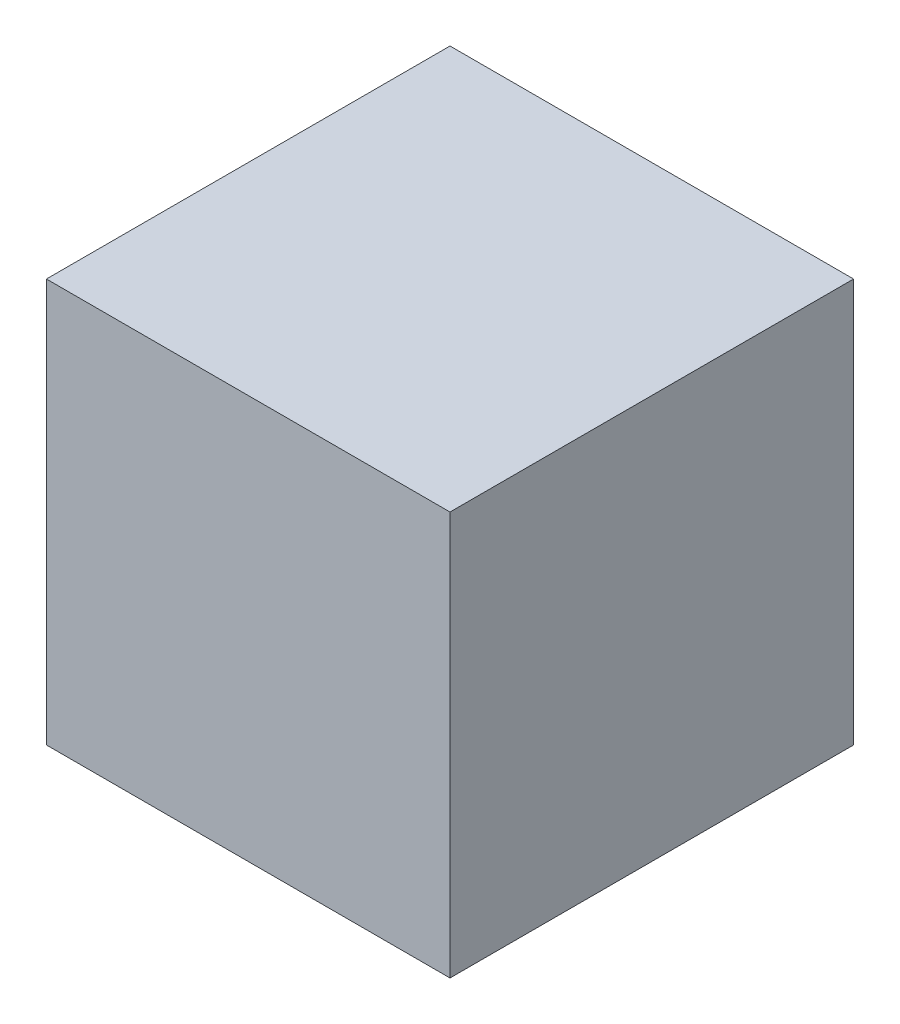
ISO-10303-21;
HEADER;
FILE_DESCRIPTION(('STEP AP214'),'2;1');
FILE_NAME('part.step','',(''),(''),'','','');
FILE_SCHEMA(('AUTOMOTIVE_DESIGN { 1 0 10303 214 1 1 1 1 }'));
ENDSEC;
DATA;
#1=APPLICATION_CONTEXT('core data for automotive mechanical design processes');
#2=APPLICATION_PROTOCOL_DEFINITION('international standard','automotive_design',2000,#1);
#3=PRODUCT_CONTEXT('',#1,'mechanical');
#4=PRODUCT('Part','Part','',(#3));
#5=PRODUCT_RELATED_PRODUCT_CATEGORY('part','',(#4));
#6=PRODUCT_DEFINITION_FORMATION('','',#4);
#7=PRODUCT_DEFINITION_CONTEXT('part definition',#1,'design');
#8=PRODUCT_DEFINITION('design','',#6,#7);
#9=PRODUCT_DEFINITION_SHAPE('','',#8);
#10=(LENGTH_UNIT() NAMED_UNIT(*) SI_UNIT(.MILLI.,.METRE.));
#11=(NAMED_UNIT(*) PLANE_ANGLE_UNIT() SI_UNIT($,.RADIAN.));
#12=(NAMED_UNIT(*) SI_UNIT($,.STERADIAN.) SOLID_ANGLE_UNIT());
#13=UNCERTAINTY_MEASURE_WITH_UNIT(LENGTH_MEASURE(1.E-05),#10,'distance_accuracy_value','');
#14=(GEOMETRIC_REPRESENTATION_CONTEXT(3) GLOBAL_UNCERTAINTY_ASSIGNED_CONTEXT((#13)) GLOBAL_UNIT_ASSIGNED_CONTEXT((#10,
#11,#12)) REPRESENTATION_CONTEXT('',''));
#15=CARTESIAN_POINT('',(0.,0.,0.));
#16=DIRECTION('',(0.,0.,1.));
#17=DIRECTION('',(1.,0.,0.));
#18=AXIS2_PLACEMENT_3D('',#15,#16,#17);
#19=CARTESIAN_POINT('',(-12.5,25.,12.5));
#20=DIRECTION('',(-1.,0.,0.));
#21=DIRECTION('',(0.,0.,1.));
#22=AXIS2_PLACEMENT_3D('',#19,#20,#21);
#23=PLANE('',#22);
#24=DIRECTION('',(0.,0.,-1.));
#25=VECTOR('',#24,1.);
#26=CARTESIAN_POINT('',(-12.5,0.,12.5));
#27=LINE('',#26,#25);
#28=CARTESIAN_POINT('',(-12.5,0.,12.5));
#29=VERTEX_POINT('',#28);
#30=CARTESIAN_POINT('',(-12.5,0.,-12.5));
#31=VERTEX_POINT('',#30);
#32=EDGE_CURVE('E110',#29,#31,#27,.T.);
#33=ORIENTED_EDGE('',*,*,#32,.F.);
#34=DIRECTION('',(0.,-1.,0.));
#35=VECTOR('',#34,1.);
#36=CARTESIAN_POINT('',(-12.5,25.,12.5));
#37=LINE('',#36,#35);
#38=CARTESIAN_POINT('',(-12.5,25.,12.5));
#39=VERTEX_POINT('',#38);
#40=EDGE_CURVE('E11',#39,#29,#37,.T.);
#41=ORIENTED_EDGE('',*,*,#40,.F.);
#42=DIRECTION('',(0.,0.,-1.));
#43=VECTOR('',#42,1.);
#44=CARTESIAN_POINT('',(-12.5,25.,12.5));
#45=LINE('',#44,#43);
#46=CARTESIAN_POINT('',(-12.5,25.,-12.5));
#47=VERTEX_POINT('',#46);
#48=EDGE_CURVE('E103',#39,#47,#45,.T.);
#49=ORIENTED_EDGE('',*,*,#48,.T.);
#50=DIRECTION('',(0.,-1.,0.));
#51=VECTOR('',#50,1.);
#52=CARTESIAN_POINT('',(-12.5,25.,-12.5));
#53=LINE('',#52,#51);
#54=EDGE_CURVE('E42',#47,#31,#53,.T.);
#55=ORIENTED_EDGE('',*,*,#54,.T.);
#56=EDGE_LOOP('',(#33,#41,#49,#55));
#57=FACE_BOUND('',#56,.T.);
#58=ADVANCED_FACE('F39',(#57),#23,.T.);
#59=CARTESIAN_POINT('',(-12.5,25.,12.5));
#60=DIRECTION('',(0.,0.,-1.));
#61=DIRECTION('',(-1.,0.,0.));
#62=AXIS2_PLACEMENT_3D('',#59,#60,#61);
#63=PLANE('',#62);
#64=DIRECTION('',(1.,0.,0.));
#65=VECTOR('',#64,1.);
#66=CARTESIAN_POINT('',(-12.5,0.,12.5));
#67=LINE('',#66,#65);
#68=CARTESIAN_POINT('',(12.5,0.,12.5));
#69=VERTEX_POINT('',#68);
#70=EDGE_CURVE('E73',#29,#69,#67,.T.);
#71=ORIENTED_EDGE('',*,*,#70,.T.);
#72=DIRECTION('',(0.,-1.,0.));
#73=VECTOR('',#72,1.);
#74=CARTESIAN_POINT('',(12.5,25.,12.5));
#75=LINE('',#74,#73);
#76=CARTESIAN_POINT('',(12.5,25.,12.5));
#77=VERTEX_POINT('',#76);
#78=EDGE_CURVE('E49',#77,#69,#75,.T.);
#79=ORIENTED_EDGE('',*,*,#78,.F.);
#80=DIRECTION('',(1.,0.,0.));
#81=VECTOR('',#80,1.);
#82=CARTESIAN_POINT('',(-12.5,25.,12.5));
#83=LINE('',#82,#81);
#84=EDGE_CURVE('E90',#39,#77,#83,.T.);
#85=ORIENTED_EDGE('',*,*,#84,.F.);
#86=ORIENTED_EDGE('',*,*,#40,.T.);
#87=EDGE_LOOP('',(#71,#79,#85,#86));
#88=FACE_BOUND('',#87,.T.);
#89=ADVANCED_FACE('F126',(#88),#63,.F.);
#90=CARTESIAN_POINT('',(12.5,25.,12.5));
#91=DIRECTION('',(-1.,0.,0.));
#92=DIRECTION('',(0.,0.,1.));
#93=AXIS2_PLACEMENT_3D('',#90,#91,#92);
#94=PLANE('',#93);
#95=DIRECTION('',(0.,0.,-1.));
#96=VECTOR('',#95,1.);
#97=CARTESIAN_POINT('',(12.5,0.,12.5));
#98=LINE('',#97,#96);
#99=CARTESIAN_POINT('',(12.5,0.,-12.5));
#100=VERTEX_POINT('',#99);
#101=EDGE_CURVE('E98',#69,#100,#98,.T.);
#102=ORIENTED_EDGE('',*,*,#101,.T.);
#103=DIRECTION('',(0.,-1.,0.));
#104=VECTOR('',#103,1.);
#105=CARTESIAN_POINT('',(12.5,25.,-12.5));
#106=LINE('',#105,#104);
#107=CARTESIAN_POINT('',(12.5,25.,-12.5));
#108=VERTEX_POINT('',#107);
#109=EDGE_CURVE('E95',#108,#100,#106,.T.);
#110=ORIENTED_EDGE('',*,*,#109,.F.);
#111=DIRECTION('',(0.,0.,-1.));
#112=VECTOR('',#111,1.);
#113=CARTESIAN_POINT('',(12.5,25.,12.5));
#114=LINE('',#113,#112);
#115=EDGE_CURVE('E85',#77,#108,#114,.T.);
#116=ORIENTED_EDGE('',*,*,#115,.F.);
#117=ORIENTED_EDGE('',*,*,#78,.T.);
#118=EDGE_LOOP('',(#102,#110,#116,#117));
#119=FACE_BOUND('',#118,.T.);
#120=ADVANCED_FACE('F96',(#119),#94,.F.);
#121=CARTESIAN_POINT('',(-12.5,25.,-12.5));
#122=DIRECTION('',(0.,0.,-1.));
#123=DIRECTION('',(-1.,0.,0.));
#124=AXIS2_PLACEMENT_3D('',#121,#122,#123);
#125=PLANE('',#124);
#126=DIRECTION('',(1.,0.,0.));
#127=VECTOR('',#126,1.);
#128=CARTESIAN_POINT('',(-12.5,0.,-12.5));
#129=LINE('',#128,#127);
#130=EDGE_CURVE('E114',#31,#100,#129,.T.);
#131=ORIENTED_EDGE('',*,*,#130,.F.);
#132=ORIENTED_EDGE('',*,*,#54,.F.);
#133=DIRECTION('',(1.,0.,0.));
#134=VECTOR('',#133,1.);
#135=CARTESIAN_POINT('',(-12.5,25.,-12.5));
#136=LINE('',#135,#134);
#137=EDGE_CURVE('E89',#47,#108,#136,.T.);
#138=ORIENTED_EDGE('',*,*,#137,.T.);
#139=ORIENTED_EDGE('',*,*,#109,.T.);
#140=EDGE_LOOP('',(#131,#132,#138,#139));
#141=FACE_BOUND('',#140,.T.);
#142=ADVANCED_FACE('F101',(#141),#125,.T.);
#143=CARTESIAN_POINT('',(0.,25.,0.));
#144=DIRECTION('',(0.,-1.,0.));
#145=DIRECTION('',(0.,0.,-1.));
#146=AXIS2_PLACEMENT_3D('',#143,#144,#145);
#147=PLANE('',#146);
#148=ORIENTED_EDGE('',*,*,#48,.F.);
#149=ORIENTED_EDGE('',*,*,#84,.T.);
#150=ORIENTED_EDGE('',*,*,#115,.T.);
#151=ORIENTED_EDGE('',*,*,#137,.F.);
#152=EDGE_LOOP('',(#148,#149,#150,#151));
#153=FACE_BOUND('',#152,.T.);
#154=ADVANCED_FACE('F88',(#153),#147,.F.);
#155=CARTESIAN_POINT('',(0.,0.,0.));
#156=DIRECTION('',(0.,-1.,0.));
#157=DIRECTION('',(0.,0.,-1.));
#158=AXIS2_PLACEMENT_3D('',#155,#156,#157);
#159=PLANE('',#158);
#160=ORIENTED_EDGE('',*,*,#32,.T.);
#161=ORIENTED_EDGE('',*,*,#130,.T.);
#162=ORIENTED_EDGE('',*,*,#101,.F.);
#163=ORIENTED_EDGE('',*,*,#70,.F.);
#164=EDGE_LOOP('',(#160,#161,#162,#163));
#165=FACE_BOUND('',#164,.T.);
#166=ADVANCED_FACE('F123',(#165),#159,.T.);
#167=CLOSED_SHELL('',(#58,#89,#120,#142,#154,#166));
#168=MANIFOLD_SOLID_BREP('B2',#167);
#169=ADVANCED_BREP_SHAPE_REPRESENTATION('',(#18,#168),#14);
#170=SHAPE_DEFINITION_REPRESENTATION(#9,#169);
ENDSEC;
END-ISO-10303-21;
